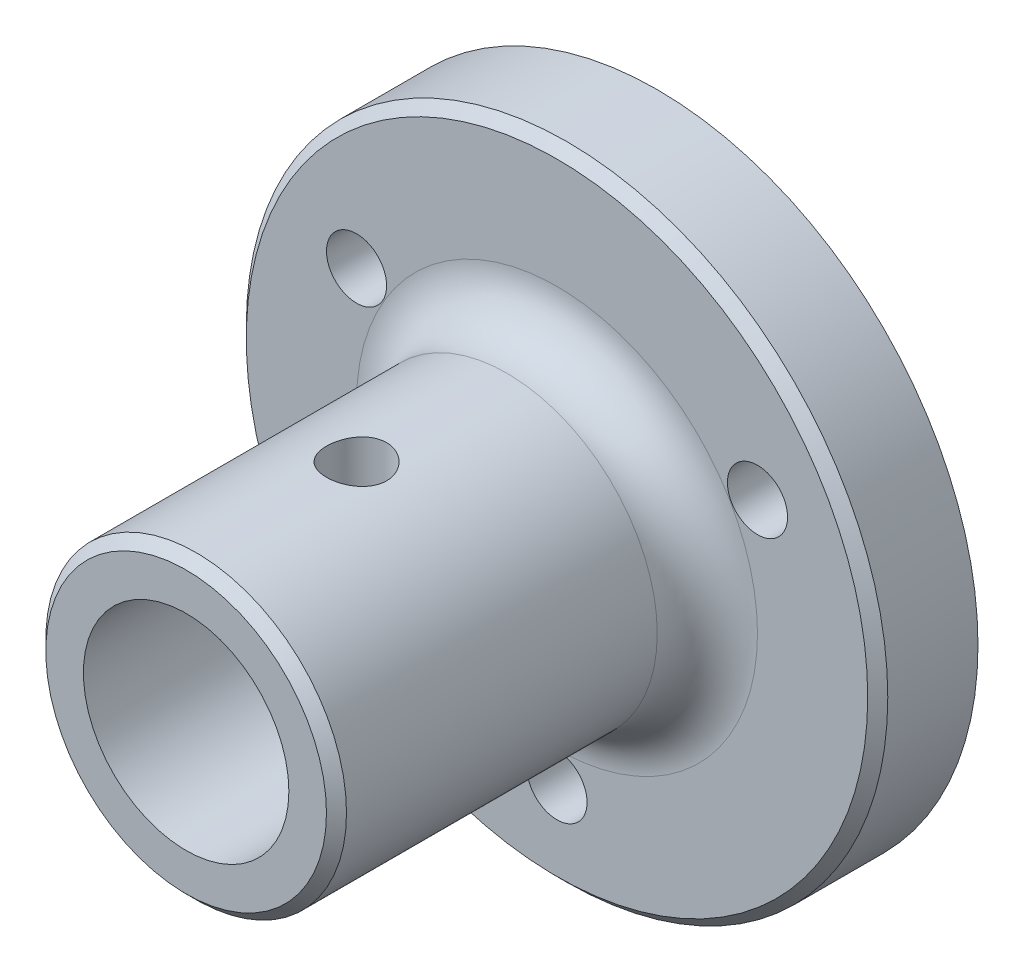
ISO-10303-21;
HEADER;
FILE_DESCRIPTION(('STEP AP214'),'2;1');
FILE_NAME('part.step','',(''),(''),'','','');
FILE_SCHEMA(('AUTOMOTIVE_DESIGN { 1 0 10303 214 1 1 1 1 }'));
ENDSEC;
DATA;
#1=APPLICATION_CONTEXT('core data for automotive mechanical design processes');
#2=APPLICATION_PROTOCOL_DEFINITION('international standard','automotive_design',2000,#1);
#3=PRODUCT_CONTEXT('',#1,'mechanical');
#4=PRODUCT('Part','Part','',(#3));
#5=PRODUCT_RELATED_PRODUCT_CATEGORY('part','',(#4));
#6=PRODUCT_DEFINITION_FORMATION('','',#4);
#7=PRODUCT_DEFINITION_CONTEXT('part definition',#1,'design');
#8=PRODUCT_DEFINITION('design','',#6,#7);
#9=PRODUCT_DEFINITION_SHAPE('','',#8);
#10=(LENGTH_UNIT() NAMED_UNIT(*) SI_UNIT(.MILLI.,.METRE.));
#11=(NAMED_UNIT(*) PLANE_ANGLE_UNIT() SI_UNIT($,.RADIAN.));
#12=(NAMED_UNIT(*) SI_UNIT($,.STERADIAN.) SOLID_ANGLE_UNIT());
#13=UNCERTAINTY_MEASURE_WITH_UNIT(LENGTH_MEASURE(1.E-05),#10,'distance_accuracy_value','');
#14=(GEOMETRIC_REPRESENTATION_CONTEXT(3) GLOBAL_UNCERTAINTY_ASSIGNED_CONTEXT((#13)) GLOBAL_UNIT_ASSIGNED_CONTEXT((#10,
#11,#12)) REPRESENTATION_CONTEXT('',''));
#15=CARTESIAN_POINT('',(0.,0.,0.));
#16=DIRECTION('',(0.,0.,1.));
#17=DIRECTION('',(1.,0.,0.));
#18=AXIS2_PLACEMENT_3D('',#15,#16,#17);
#19=CARTESIAN_POINT('',(0.,0.,10.));
#20=DIRECTION('',(0.,0.,1.));
#21=DIRECTION('',(1.,0.,0.));
#22=AXIS2_PLACEMENT_3D('',#19,#20,#21);
#23=PLANE('',#22);
#24=CARTESIAN_POINT('',(0.,0.,10.));
#25=DIRECTION('',(0.,0.,1.));
#26=DIRECTION('',(1.,0.,0.));
#27=AXIS2_PLACEMENT_3D('',#24,#25,#26);
#28=CIRCLE('',#27,31.);
#29=CARTESIAN_POINT('',(31.,0.,10.));
#30=VERTEX_POINT('',#29);
#31=EDGE_CURVE('E44',#30,#30,#28,.T.);
#32=ORIENTED_EDGE('',*,*,#31,.T.);
#33=EDGE_LOOP('',(#32));
#34=FACE_BOUND('',#33,.T.);
#35=CARTESIAN_POINT('',(0.,0.,10.));
#36=DIRECTION('',(0.,0.,1.));
#37=DIRECTION('',(1.,0.,0.));
#38=AXIS2_PLACEMENT_3D('',#35,#36,#37);
#39=CIRCLE('',#38,20.);
#40=CARTESIAN_POINT('',(20.,0.,10.));
#41=VERTEX_POINT('',#40);
#42=EDGE_CURVE('E57',#41,#41,#39,.F.);
#43=ORIENTED_EDGE('',*,*,#42,.T.);
#44=EDGE_LOOP('',(#43));
#45=FACE_BOUND('',#44,.T.);
#46=CARTESIAN_POINT('',(0.,-23.094010767585,10.));
#47=DIRECTION('',(0.,0.,1.));
#48=DIRECTION('',(1.,0.,0.));
#49=AXIS2_PLACEMENT_3D('',#46,#47,#48);
#50=CIRCLE('',#49,3.);
#51=CARTESIAN_POINT('',(3.,-23.094010767585,10.));
#52=VERTEX_POINT('',#51);
#53=EDGE_CURVE('E162',#52,#52,#50,.T.);
#54=ORIENTED_EDGE('',*,*,#53,.F.);
#55=EDGE_LOOP('',(#54));
#56=FACE_BOUND('',#55,.T.);
#57=CARTESIAN_POINT('',(20.,11.5470053837925,10.));
#58=DIRECTION('',(0.,0.,1.));
#59=DIRECTION('',(1.,0.,0.));
#60=AXIS2_PLACEMENT_3D('',#57,#58,#59);
#61=CIRCLE('',#60,3.);
#62=CARTESIAN_POINT('',(23.,11.5470053837925,10.));
#63=VERTEX_POINT('',#62);
#64=EDGE_CURVE('E168',#63,#63,#61,.T.);
#65=ORIENTED_EDGE('',*,*,#64,.F.);
#66=EDGE_LOOP('',(#65));
#67=FACE_BOUND('',#66,.T.);
#68=CARTESIAN_POINT('',(-20.,11.5470053837925,10.));
#69=DIRECTION('',(0.,0.,1.));
#70=DIRECTION('',(1.,0.,0.));
#71=AXIS2_PLACEMENT_3D('',#68,#69,#70);
#72=CIRCLE('',#71,3.);
#73=CARTESIAN_POINT('',(-17.,11.5470053837925,10.));
#74=VERTEX_POINT('',#73);
#75=EDGE_CURVE('E155',#74,#74,#72,.T.);
#76=ORIENTED_EDGE('',*,*,#75,.F.);
#77=EDGE_LOOP('',(#76));
#78=FACE_BOUND('',#77,.T.);
#79=ADVANCED_FACE('F36',(#34,#45,#56,#67,#78),#23,.T.);
#80=CARTESIAN_POINT('',(0.,0.,0.));
#81=DIRECTION('',(0.,0.,1.));
#82=DIRECTION('',(1.,0.,0.));
#83=AXIS2_PLACEMENT_3D('',#80,#81,#82);
#84=PLANE('',#83);
#85=CARTESIAN_POINT('',(0.,0.,0.));
#86=DIRECTION('',(0.,0.,1.));
#87=DIRECTION('',(1.,0.,0.));
#88=AXIS2_PLACEMENT_3D('',#85,#86,#87);
#89=CIRCLE('',#88,32.);
#90=CARTESIAN_POINT('',(32.,0.,0.));
#91=VERTEX_POINT('',#90);
#92=EDGE_CURVE('E171',#91,#91,#89,.T.);
#93=ORIENTED_EDGE('',*,*,#92,.F.);
#94=EDGE_LOOP('',(#93));
#95=FACE_BOUND('',#94,.T.);
#96=CARTESIAN_POINT('',(20.,11.5470053837925,0.));
#97=DIRECTION('',(0.,0.,1.));
#98=DIRECTION('',(1.,0.,0.));
#99=AXIS2_PLACEMENT_3D('',#96,#97,#98);
#100=CIRCLE('',#99,3.);
#101=CARTESIAN_POINT('',(23.,11.5470053837925,0.));
#102=VERTEX_POINT('',#101);
#103=EDGE_CURVE('E165',#102,#102,#100,.T.);
#104=ORIENTED_EDGE('',*,*,#103,.T.);
#105=EDGE_LOOP('',(#104));
#106=FACE_BOUND('',#105,.T.);
#107=CARTESIAN_POINT('',(0.,-23.094010767585,0.));
#108=DIRECTION('',(0.,0.,1.));
#109=DIRECTION('',(1.,0.,0.));
#110=AXIS2_PLACEMENT_3D('',#107,#108,#109);
#111=CIRCLE('',#110,3.);
#112=CARTESIAN_POINT('',(3.,-23.094010767585,0.));
#113=VERTEX_POINT('',#112);
#114=EDGE_CURVE('E160',#113,#113,#111,.T.);
#115=ORIENTED_EDGE('',*,*,#114,.T.);
#116=EDGE_LOOP('',(#115));
#117=FACE_BOUND('',#116,.T.);
#118=CARTESIAN_POINT('',(-20.,11.5470053837925,0.));
#119=DIRECTION('',(0.,0.,1.));
#120=DIRECTION('',(1.,0.,0.));
#121=AXIS2_PLACEMENT_3D('',#118,#119,#120);
#122=CIRCLE('',#121,3.);
#123=CARTESIAN_POINT('',(-17.,11.5470053837925,0.));
#124=VERTEX_POINT('',#123);
#125=EDGE_CURVE('E153',#124,#124,#122,.T.);
#126=ORIENTED_EDGE('',*,*,#125,.T.);
#127=EDGE_LOOP('',(#126));
#128=FACE_BOUND('',#127,.T.);
#129=ADVANCED_FACE('F124',(#95,#106,#117,#128),#84,.F.);
#130=CARTESIAN_POINT('',(0.,0.,10.));
#131=DIRECTION('',(0.,0.,-1.));
#132=DIRECTION('',(-1.,0.,0.));
#133=AXIS2_PLACEMENT_3D('',#130,#131,#132);
#134=CYLINDRICAL_SURFACE('',#133,32.);
#135=CARTESIAN_POINT('',(0.,0.,9.00000000000001));
#136=DIRECTION('',(0.,0.,1.));
#137=DIRECTION('',(1.,0.,0.));
#138=AXIS2_PLACEMENT_3D('',#135,#136,#137);
#139=CIRCLE('',#138,32.);
#140=CARTESIAN_POINT('',(32.,0.,9.00000000000001));
#141=VERTEX_POINT('',#140);
#142=EDGE_CURVE('E10',#141,#141,#139,.F.);
#143=ORIENTED_EDGE('',*,*,#142,.T.);
#144=EDGE_LOOP('',(#143));
#145=FACE_BOUND('',#144,.T.);
#146=ORIENTED_EDGE('',*,*,#92,.T.);
#147=EDGE_LOOP('',(#146));
#148=FACE_BOUND('',#147,.T.);
#149=ADVANCED_FACE('F120',(#145,#148),#134,.T.);
#150=CARTESIAN_POINT('',(20.,11.5470053837925,10.));
#151=DIRECTION('',(0.,0.,-1.));
#152=DIRECTION('',(-1.,0.,0.));
#153=AXIS2_PLACEMENT_3D('',#150,#151,#152);
#154=CYLINDRICAL_SURFACE('',#153,3.);
#155=ORIENTED_EDGE('',*,*,#64,.T.);
#156=EDGE_LOOP('',(#155));
#157=FACE_BOUND('',#156,.T.);
#158=ORIENTED_EDGE('',*,*,#103,.F.);
#159=EDGE_LOOP('',(#158));
#160=FACE_BOUND('',#159,.T.);
#161=ADVANCED_FACE('F116',(#157,#160),#154,.F.);
#162=CARTESIAN_POINT('',(0.,-23.094010767585,10.));
#163=DIRECTION('',(0.,0.,-1.));
#164=DIRECTION('',(-1.,0.,0.));
#165=AXIS2_PLACEMENT_3D('',#162,#163,#164);
#166=CYLINDRICAL_SURFACE('',#165,3.);
#167=ORIENTED_EDGE('',*,*,#53,.T.);
#168=EDGE_LOOP('',(#167));
#169=FACE_BOUND('',#168,.T.);
#170=ORIENTED_EDGE('',*,*,#114,.F.);
#171=EDGE_LOOP('',(#170));
#172=FACE_BOUND('',#171,.T.);
#173=ADVANCED_FACE('F112',(#169,#172),#166,.F.);
#174=CARTESIAN_POINT('',(-20.,11.5470053837925,10.));
#175=DIRECTION('',(0.,0.,-1.));
#176=DIRECTION('',(-1.,0.,0.));
#177=AXIS2_PLACEMENT_3D('',#174,#175,#176);
#178=CYLINDRICAL_SURFACE('',#177,3.);
#179=ORIENTED_EDGE('',*,*,#75,.T.);
#180=EDGE_LOOP('',(#179));
#181=FACE_BOUND('',#180,.T.);
#182=ORIENTED_EDGE('',*,*,#125,.F.);
#183=EDGE_LOOP('',(#182));
#184=FACE_BOUND('',#183,.T.);
#185=ADVANCED_FACE('F108',(#181,#184),#178,.F.);
#186=CARTESIAN_POINT('',(0.,0.,47.));
#187=DIRECTION('',(0.,0.,1.));
#188=DIRECTION('',(1.,0.,0.));
#189=AXIS2_PLACEMENT_3D('',#186,#187,#188);
#190=PLANE('',#189);
#191=CARTESIAN_POINT('',(0.,0.,47.));
#192=DIRECTION('',(0.,0.,1.));
#193=DIRECTION('',(1.,0.,0.));
#194=AXIS2_PLACEMENT_3D('',#191,#192,#193);
#195=CIRCLE('',#194,14.);
#196=CARTESIAN_POINT('',(14.,0.,47.));
#197=VERTEX_POINT('',#196);
#198=EDGE_CURVE('E52',#197,#197,#195,.T.);
#199=ORIENTED_EDGE('',*,*,#198,.T.);
#200=EDGE_LOOP('',(#199));
#201=FACE_BOUND('',#200,.T.);
#202=CARTESIAN_POINT('',(0.,0.,47.));
#203=DIRECTION('',(0.,0.,1.));
#204=DIRECTION('',(1.,0.,0.));
#205=AXIS2_PLACEMENT_3D('',#202,#203,#204);
#206=CIRCLE('',#205,10.25);
#207=CARTESIAN_POINT('',(10.25,0.,47.));
#208=VERTEX_POINT('',#207);
#209=EDGE_CURVE('E151',#208,#208,#206,.T.);
#210=ORIENTED_EDGE('',*,*,#209,.F.);
#211=EDGE_LOOP('',(#210));
#212=FACE_BOUND('',#211,.T.);
#213=ADVANCED_FACE('F106',(#201,#212),#190,.T.);
#214=CARTESIAN_POINT('',(0.,0.,47.));
#215=DIRECTION('',(0.,0.,-1.));
#216=DIRECTION('',(-1.,0.,0.));
#217=AXIS2_PLACEMENT_3D('',#214,#215,#216);
#218=CYLINDRICAL_SURFACE('',#217,15.);
#219=CARTESIAN_POINT('',(0.,0.,46.));
#220=DIRECTION('',(0.,0.,1.));
#221=DIRECTION('',(1.,0.,0.));
#222=AXIS2_PLACEMENT_3D('',#219,#220,#221);
#223=CIRCLE('',#222,15.);
#224=CARTESIAN_POINT('',(15.,0.,46.));
#225=VERTEX_POINT('',#224);
#226=EDGE_CURVE('E48',#225,#225,#223,.F.);
#227=ORIENTED_EDGE('',*,*,#226,.T.);
#228=EDGE_LOOP('',(#227));
#229=FACE_BOUND('',#228,.T.);
#230=CARTESIAN_POINT('',(0.,0.,15.));
#231=DIRECTION('',(0.,0.,1.));
#232=DIRECTION('',(1.,0.,0.));
#233=AXIS2_PLACEMENT_3D('',#230,#231,#232);
#234=CIRCLE('',#233,15.);
#235=CARTESIAN_POINT('',(15.,0.,15.));
#236=VERTEX_POINT('',#235);
#237=EDGE_CURVE('E60',#236,#236,#234,.T.);
#238=ORIENTED_EDGE('',*,*,#237,.T.);
#239=EDGE_LOOP('',(#238));
#240=FACE_BOUND('',#239,.T.);
#241=CARTESIAN_POINT('',(0.,-15.,33.));
#242=CARTESIAN_POINT('',(0.166730720377901,-14.9999969274261,32.999993866505));
#243=CARTESIAN_POINT('',(0.333538980604569,-14.9971915553469,32.9860534710971));
#244=CARTESIAN_POINT('',(0.66244052306706,-14.9862709686969,32.9307044996543));
#245=CARTESIAN_POINT('',(0.824529952624069,-14.9781515358056,32.8892741015955));
#246=CARTESIAN_POINT('',(1.13919091578994,-14.9575094783486,32.7802761791376));
#247=CARTESIAN_POINT('',(1.2917714037994,-14.9449910723015,32.7127336894659));
#248=CARTESIAN_POINT('',(1.58342396659268,-14.9169119410594,32.5535032574661));
#249=CARTESIAN_POINT('',(1.72249684522744,-14.9013513970712,32.4618167531784));
#250=CARTESIAN_POINT('',(1.98508043194459,-14.8686649598991,32.2555845171257));
#251=CARTESIAN_POINT('',(2.10838185347557,-14.8515223651304,32.1407749338264));
#252=CARTESIAN_POINT('',(2.33411026982409,-14.8177254135776,31.8921227508249));
#253=CARTESIAN_POINT('',(2.43653563431128,-14.8010710950127,31.7582786659946));
#254=CARTESIAN_POINT('',(2.61849526004286,-14.7699732543785,31.4738514209644));
#255=CARTESIAN_POINT('',(2.6978128165976,-14.7555512209484,31.3231270686109));
#256=CARTESIAN_POINT('',(2.82991699974093,-14.7307880417525,31.0101545429878));
#257=CARTESIAN_POINT('',(2.88270624731171,-14.7204464928589,30.847907509961));
#258=CARTESIAN_POINT('',(2.95957589965448,-14.7051841575661,30.5187469082762));
#259=CARTESIAN_POINT('',(2.98402349387633,-14.7001941032156,30.3519223675733));
#260=CARTESIAN_POINT('',(3.00465638317836,-14.6959912518188,30.016470535907));
#261=CARTESIAN_POINT('',(3.0008445681405,-14.6967778640352,29.8478434310396));
#262=CARTESIAN_POINT('',(2.96536371930546,-14.7039765344455,29.516259635937));
#263=CARTESIAN_POINT('',(2.93411562073172,-14.7103035857629,29.3532557831181));
#264=CARTESIAN_POINT('',(2.84531365386915,-14.7277363848,29.034851770011));
#265=CARTESIAN_POINT('',(2.78775852930205,-14.7388423607334,28.879451973243));
#266=CARTESIAN_POINT('',(2.64757435102416,-14.7646685550122,28.5794542148892));
#267=CARTESIAN_POINT('',(2.56477845369635,-14.7794126944111,28.4349363612925));
#268=CARTESIAN_POINT('',(2.37658072371804,-14.8108385631919,28.1616874500816));
#269=CARTESIAN_POINT('',(2.27117629307049,-14.827520515151,28.0329582094465));
#270=CARTESIAN_POINT('',(2.03849980368175,-14.8613106372439,27.7925117926292));
#271=CARTESIAN_POINT('',(1.91086848363734,-14.8784210763271,27.6811422964226));
#272=CARTESIAN_POINT('',(1.63855507218603,-14.9108654614323,27.4813384610963));
#273=CARTESIAN_POINT('',(1.49387276213817,-14.9261993846692,27.3929044161193));
#274=CARTESIAN_POINT('',(1.19117816063676,-14.9534007048266,27.2414174723221));
#275=CARTESIAN_POINT('',(1.0331454587559,-14.9652626654482,27.1784043190664));
#276=CARTESIAN_POINT('',(0.708446929345996,-14.9841422696357,27.0799185778843));
#277=CARTESIAN_POINT('',(0.541782150217351,-14.9911605000159,27.0444426537791));
#278=CARTESIAN_POINT('',(0.207538216881454,-14.999480156006,27.0025306386172));
#279=CARTESIAN_POINT('',(0.0400209849767314,-15.0008752395741,26.9956187413792));
#280=CARTESIAN_POINT('',(-0.293774802578139,-14.9980515579031,27.0097495768265));
#281=CARTESIAN_POINT('',(-0.460053427331377,-14.9938331082434,27.0307907380578));
#282=CARTESIAN_POINT('',(-0.785116979839619,-14.9803149602405,27.0998351206319));
#283=CARTESIAN_POINT('',(-0.943955845019705,-14.9710612921262,27.1475942054937));
#284=CARTESIAN_POINT('',(-1.251370882499,-14.948506561831,27.2684519479674));
#285=CARTESIAN_POINT('',(-1.39994628491262,-14.9352051964268,27.3415525040305));
#286=CARTESIAN_POINT('',(-1.68462352105865,-14.9057973459988,27.5120474719539));
#287=CARTESIAN_POINT('',(-1.82055038025656,-14.8896585131116,27.6097283431168));
#288=CARTESIAN_POINT('',(-2.07425405735762,-14.8564420448965,27.8262275736218));
#289=CARTESIAN_POINT('',(-2.19202892679229,-14.8393643090516,27.9450481991996));
#290=CARTESIAN_POINT('',(-2.40792177232253,-14.8058791067089,28.2026200556734));
#291=CARTESIAN_POINT('',(-2.50571310734596,-14.7894858069991,28.341647232664));
#292=CARTESIAN_POINT('',(-2.67655626015362,-14.7595257538858,28.63443408407));
#293=CARTESIAN_POINT('',(-2.74960906776871,-14.7459588874003,28.7881931687207));
#294=CARTESIAN_POINT('',(-2.86845552474588,-14.7233022175315,29.1053047384486));
#295=CARTESIAN_POINT('',(-2.91439049937315,-14.7141892461656,29.268602523631));
#296=CARTESIAN_POINT('',(-2.97812595488159,-14.7014231037608,29.6008003604727));
#297=CARTESIAN_POINT('',(-2.99593010467534,-14.6977692207333,29.769699678628));
#298=CARTESIAN_POINT('',(-3.0027627326024,-14.6963744889414,30.105026593633));
#299=CARTESIAN_POINT('',(-2.99230736421269,-14.698527575679,30.271443446781));
#300=CARTESIAN_POINT('',(-2.94405691230018,-14.7082672045384,30.6000949497151));
#301=CARTESIAN_POINT('',(-2.90626204838789,-14.7158537030151,30.7623296330844));
#302=CARTESIAN_POINT('',(-2.80463570549686,-14.7355579265748,31.0776831337216));
#303=CARTESIAN_POINT('',(-2.74086752015203,-14.7476646305649,31.2308230815072));
#304=CARTESIAN_POINT('',(-2.58916393380481,-14.7750514492251,31.5243111622033));
#305=CARTESIAN_POINT('',(-2.50122650632465,-14.7903318299668,31.6646582211754));
#306=CARTESIAN_POINT('',(-2.30191774435924,-14.8226688156968,31.9311467164509));
#307=CARTESIAN_POINT('',(-2.19017366170554,-14.839751187291,32.0570062958028));
#308=CARTESIAN_POINT('',(-1.94719310703942,-14.8735824561586,32.2883586165875));
#309=CARTESIAN_POINT('',(-1.81595216146,-14.8903312758955,32.3938466709518));
#310=CARTESIAN_POINT('',(-1.53605288726474,-14.9218149716391,32.5825039318393));
#311=CARTESIAN_POINT('',(-1.3872266532895,-14.9365269365774,32.6654280098401));
#312=CARTESIAN_POINT('',(-1.0774990828222,-14.96205375255,32.8049583677898));
#313=CARTESIAN_POINT('',(-0.916608782589378,-14.9728721141585,32.8615883685975));
#314=CARTESIAN_POINT('',(-0.629464466771338,-14.9872911778611,32.9359558441341));
#315=CARTESIAN_POINT('',(-0.504844992041353,-14.9920290947535,32.9599295811233));
#316=CARTESIAN_POINT('',(-0.253498575630199,-14.9983846241968,32.9919537370751));
#317=CARTESIAN_POINT('',(-0.126771701245855,-15.0000023361946,33.0000046635293));
#318=CARTESIAN_POINT('',(0.,-15.,33.));
#319=B_SPLINE_CURVE_WITH_KNOTS('',3,(#241,#242,#243,#244,#245,#246,#247,#248,#249,#250,#251,
#252,#253,#254,#255,#256,#257,#258,#259,#260,#261,#262,#263,#264,#265,#266,#267,#268,#269,#270,
#271,#272,#273,#274,#275,#276,#277,#278,#279,#280,#281,#282,#283,#284,#285,#286,#287,#288,#289,
#290,#291,#292,#293,#294,#295,#296,#297,#298,#299,#300,#301,#302,#303,#304,#305,#306,#307,#308,
#309,#310,#311,#312,#313,#314,#315,#316,#317,#318),.UNSPECIFIED.,.T.,.F.,(4,2,2,2,2,2,2,2,2,2,2,
2,2,2,2,2,2,2,2,2,2,2,2,2,2,2,2,2,2,2,2,2,2,2,2,2,2,2,4),(0.,0.499728391983775,
0.999853952073969,1.49950120575102,1.99911870669259,2.50479801033655,3.0105167902421,
3.52083585017768,4.03110448095592,4.53468555310762,5.03821512843675,5.53415181018835,
6.03011217761189,6.52942470610778,7.02879464249012,7.53714757474052,8.04550702619461,
8.55465824562072,9.06374777094108,9.56432207028796,10.064868229736,10.5609136185217,
11.0569961764807,11.5591519810008,12.0613616503779,12.5712188573768,13.081055661704,
13.5882114309817,14.0953010499124,14.593191677031,15.0910783047783,15.5877588375933,
16.084481027456,16.5896422871743,17.0949196359879,17.6054849002691,18.1155886655256,
18.4955632586968,18.8755257411299),.UNSPECIFIED.);
#320=CARTESIAN_POINT('',(0.,-15.,33.));
#321=VERTEX_POINT('',#320);
#322=EDGE_CURVE('E97',#321,#321,#319,.T.);
#323=ORIENTED_EDGE('',*,*,#322,.T.);
#324=EDGE_LOOP('',(#323));
#325=FACE_BOUND('',#324,.T.);
#326=CARTESIAN_POINT('',(0.,15.,33.));
#327=CARTESIAN_POINT('',(-0.166730720377898,14.9999969274261,32.999993866505));
#328=CARTESIAN_POINT('',(-0.333538980604565,14.9971915553469,32.9860534710971));
#329=CARTESIAN_POINT('',(-0.662440523067056,14.9862709686969,32.9307044996543));
#330=CARTESIAN_POINT('',(-0.824529952624065,14.9781515358056,32.8892741015955));
#331=CARTESIAN_POINT('',(-1.13919091578994,14.9575094783486,32.7802761791376));
#332=CARTESIAN_POINT('',(-1.2917714037994,14.9449910723015,32.7127336894659));
#333=CARTESIAN_POINT('',(-1.58342396659267,14.9169119410594,32.5535032574661));
#334=CARTESIAN_POINT('',(-1.72249684522743,14.9013513970712,32.4618167531784));
#335=CARTESIAN_POINT('',(-1.98508043194459,14.8686649598991,32.2555845171257));
#336=CARTESIAN_POINT('',(-2.10838185347557,14.8515223651304,32.1407749338264));
#337=CARTESIAN_POINT('',(-2.33411026982408,14.8177254135776,31.8921227508249));
#338=CARTESIAN_POINT('',(-2.43653563431127,14.8010710950127,31.7582786659946));
#339=CARTESIAN_POINT('',(-2.61849526004286,14.7699732543785,31.4738514209644));
#340=CARTESIAN_POINT('',(-2.6978128165976,14.7555512209484,31.3231270686109));
#341=CARTESIAN_POINT('',(-2.82991699974092,14.7307880417525,31.0101545429878));
#342=CARTESIAN_POINT('',(-2.88270624731171,14.7204464928588,30.847907509961));
#343=CARTESIAN_POINT('',(-2.95957589965448,14.7051841575661,30.5187469082762));
#344=CARTESIAN_POINT('',(-2.98402349387633,14.7001941032156,30.3519223675733));
#345=CARTESIAN_POINT('',(-3.00465638317836,14.6959912518188,30.016470535907));
#346=CARTESIAN_POINT('',(-3.0008445681405,14.6967778640352,29.8478434310396));
#347=CARTESIAN_POINT('',(-2.96536371930546,14.7039765344455,29.516259635937));
#348=CARTESIAN_POINT('',(-2.93411562073172,14.7103035857629,29.3532557831181));
#349=CARTESIAN_POINT('',(-2.84531365386915,14.7277363848,29.034851770011));
#350=CARTESIAN_POINT('',(-2.78775852930204,14.7388423607334,28.879451973243));
#351=CARTESIAN_POINT('',(-2.64757435102416,14.7646685550122,28.5794542148892));
#352=CARTESIAN_POINT('',(-2.56477845369634,14.7794126944111,28.4349363612925));
#353=CARTESIAN_POINT('',(-2.37658072371804,14.8108385631919,28.1616874500816));
#354=CARTESIAN_POINT('',(-2.27117629307049,14.827520515151,28.0329582094465));
#355=CARTESIAN_POINT('',(-2.03849980368175,14.8613106372439,27.7925117926292));
#356=CARTESIAN_POINT('',(-1.91086848363733,14.8784210763271,27.6811422964226));
#357=CARTESIAN_POINT('',(-1.63855507218603,14.9108654614323,27.4813384610963));
#358=CARTESIAN_POINT('',(-1.49387276213817,14.9261993846692,27.3929044161193));
#359=CARTESIAN_POINT('',(-1.19117816063676,14.9534007048266,27.2414174723221));
#360=CARTESIAN_POINT('',(-1.0331454587559,14.9652626654482,27.1784043190664));
#361=CARTESIAN_POINT('',(-0.708446929345993,14.9841422696357,27.0799185778843));
#362=CARTESIAN_POINT('',(-0.541782150217348,14.9911605000159,27.0444426537791));
#363=CARTESIAN_POINT('',(-0.207538216881451,14.999480156006,27.0025306386172));
#364=CARTESIAN_POINT('',(-0.0400209849767283,15.0008752395741,26.9956187413792));
#365=CARTESIAN_POINT('',(0.293774802578143,14.9980515579031,27.0097495768265));
#366=CARTESIAN_POINT('',(0.46005342733138,14.9938331082434,27.0307907380578));
#367=CARTESIAN_POINT('',(0.785116979839623,14.9803149602405,27.0998351206319));
#368=CARTESIAN_POINT('',(0.943955845019709,14.9710612921262,27.1475942054937));
#369=CARTESIAN_POINT('',(1.251370882499,14.948506561831,27.2684519479674));
#370=CARTESIAN_POINT('',(1.39994628491262,14.9352051964268,27.3415525040305));
#371=CARTESIAN_POINT('',(1.68462352105865,14.9057973459988,27.5120474719539));
#372=CARTESIAN_POINT('',(1.82055038025656,14.8896585131116,27.6097283431168));
#373=CARTESIAN_POINT('',(2.07425405735762,14.8564420448965,27.8262275736218));
#374=CARTESIAN_POINT('',(2.19202892679229,14.8393643090516,27.9450481991996));
#375=CARTESIAN_POINT('',(2.40792177232253,14.8058791067089,28.2026200556734));
#376=CARTESIAN_POINT('',(2.50571310734597,14.7894858069991,28.341647232664));
#377=CARTESIAN_POINT('',(2.67655626015362,14.7595257538858,28.63443408407));
#378=CARTESIAN_POINT('',(2.74960906776871,14.7459588874003,28.7881931687207));
#379=CARTESIAN_POINT('',(2.86845552474588,14.7233022175315,29.1053047384486));
#380=CARTESIAN_POINT('',(2.91439049937315,14.7141892461656,29.268602523631));
#381=CARTESIAN_POINT('',(2.97812595488159,14.7014231037608,29.6008003604727));
#382=CARTESIAN_POINT('',(2.99593010467534,14.6977692207333,29.769699678628));
#383=CARTESIAN_POINT('',(3.00276273260241,14.6963744889414,30.105026593633));
#384=CARTESIAN_POINT('',(2.99230736421269,14.698527575679,30.271443446781));
#385=CARTESIAN_POINT('',(2.94405691230018,14.7082672045384,30.6000949497151));
#386=CARTESIAN_POINT('',(2.9062620483879,14.7158537030151,30.7623296330844));
#387=CARTESIAN_POINT('',(2.80463570549687,14.7355579265748,31.0776831337216));
#388=CARTESIAN_POINT('',(2.74086752015204,14.7476646305649,31.2308230815072));
#389=CARTESIAN_POINT('',(2.58916393380482,14.7750514492251,31.5243111622033));
#390=CARTESIAN_POINT('',(2.50122650632465,14.7903318299668,31.6646582211754));
#391=CARTESIAN_POINT('',(2.30191774435925,14.8226688156968,31.9311467164509));
#392=CARTESIAN_POINT('',(2.19017366170555,14.839751187291,32.0570062958028));
#393=CARTESIAN_POINT('',(1.94719310703943,14.8735824561586,32.2883586165875));
#394=CARTESIAN_POINT('',(1.81595216146001,14.8903312758955,32.3938466709518));
#395=CARTESIAN_POINT('',(1.53605288726474,14.9218149716391,32.5825039318393));
#396=CARTESIAN_POINT('',(1.3872266532895,14.9365269365774,32.6654280098401));
#397=CARTESIAN_POINT('',(1.0774990828222,14.96205375255,32.8049583677898));
#398=CARTESIAN_POINT('',(0.91660878258938,14.9728721141585,32.8615883685975));
#399=CARTESIAN_POINT('',(0.629464466771343,14.9872911778611,32.9359558441341));
#400=CARTESIAN_POINT('',(0.504844992041359,14.9920290947536,32.9599295811233));
#401=CARTESIAN_POINT('',(0.253498575630206,14.9983846241968,32.9919537370751));
#402=CARTESIAN_POINT('',(0.12677170124586,15.0000023361946,33.0000046635293));
#403=CARTESIAN_POINT('',(0.,15.,33.));
#404=B_SPLINE_CURVE_WITH_KNOTS('',3,(#326,#327,#328,#329,#330,#331,#332,#333,#334,#335,#336,
#337,#338,#339,#340,#341,#342,#343,#344,#345,#346,#347,#348,#349,#350,#351,#352,#353,#354,#355,
#356,#357,#358,#359,#360,#361,#362,#363,#364,#365,#366,#367,#368,#369,#370,#371,#372,#373,#374,
#375,#376,#377,#378,#379,#380,#381,#382,#383,#384,#385,#386,#387,#388,#389,#390,#391,#392,#393,
#394,#395,#396,#397,#398,#399,#400,#401,#402,#403),.UNSPECIFIED.,.T.,.F.,(4,2,2,2,2,2,2,2,2,2,2,
2,2,2,2,2,2,2,2,2,2,2,2,2,2,2,2,2,2,2,2,2,2,2,2,2,2,2,4),(0.,0.499728391983775,
0.999853952073969,1.49950120575102,1.99911870669259,2.50479801033656,3.0105167902421,
3.52083585017768,4.03110448095592,4.53468555310762,5.03821512843675,5.53415181018835,
6.03011217761189,6.52942470610778,7.02879464249012,7.53714757474052,8.04550702619461,
8.55465824562072,9.06374777094108,9.56432207028796,10.064868229736,10.5609136185217,
11.0569961764807,11.5591519810008,12.0613616503779,12.5712188573768,13.081055661704,
13.5882114309817,14.0953010499124,14.593191677031,15.0910783047783,15.5877588375933,
16.084481027456,16.5896422871743,17.0949196359879,17.6054849002691,18.1155886655256,
18.4955632586968,18.8755257411299),.UNSPECIFIED.);
#405=CARTESIAN_POINT('',(0.,15.,33.));
#406=VERTEX_POINT('',#405);
#407=EDGE_CURVE('E72',#406,#406,#404,.T.);
#408=ORIENTED_EDGE('',*,*,#407,.T.);
#409=EDGE_LOOP('',(#408));
#410=FACE_BOUND('',#409,.T.);
#411=ADVANCED_FACE('F102',(#229,#240,#325,#410),#218,.T.);
#412=CARTESIAN_POINT('',(0.,0.,47.));
#413=DIRECTION('',(0.,0.,-1.));
#414=DIRECTION('',(-1.,0.,0.));
#415=AXIS2_PLACEMENT_3D('',#412,#413,#414);
#416=CYLINDRICAL_SURFACE('',#415,10.25);
#417=CARTESIAN_POINT('',(0.,-10.25,33.));
#418=CARTESIAN_POINT('',(0.164761030351973,-10.2499982885748,32.9999975190535));
#419=CARTESIAN_POINT('',(0.329547295458406,-10.2459891477057,32.9863817687285));
#420=CARTESIAN_POINT('',(0.654332795535697,-10.230386996352,32.9324001987746));
#421=CARTESIAN_POINT('',(0.814330385454751,-10.2187914102722,32.8920252943628));
#422=CARTESIAN_POINT('',(1.12480632609575,-10.1892890680163,32.7859804168264));
#423=CARTESIAN_POINT('',(1.27529796475204,-10.1713913623467,32.7203467055076));
#424=CARTESIAN_POINT('',(1.56313982492937,-10.1311520971023,32.5657928042986));
#425=CARTESIAN_POINT('',(1.70048848640622,-10.1088100109555,32.4768698546939));
#426=CARTESIAN_POINT('',(1.96191733576444,-10.0613857012864,32.2756873283128));
#427=CARTESIAN_POINT('',(2.08558550559553,-10.0362493869492,32.1629051234802));
#428=CARTESIAN_POINT('',(2.31255048619464,-9.98639778591535,31.9183201581798));
#429=CARTESIAN_POINT('',(2.41584406583257,-9.96168256656547,31.7865143865661));
#430=CARTESIAN_POINT('',(2.60125899002276,-9.91490371417962,31.5041829707671));
#431=CARTESIAN_POINT('',(2.68288409015477,-9.89290754305841,31.3533192064768));
#432=CARTESIAN_POINT('',(2.81943980977289,-9.8548627546537,31.039259257862));
#433=CARTESIAN_POINT('',(2.87437649194788,-9.83881278679458,30.8760658841424));
#434=CARTESIAN_POINT('',(2.95452269393277,-9.81504013380612,30.5465920394521));
#435=CARTESIAN_POINT('',(2.98048902579986,-9.80710592181539,30.380511329967));
#436=CARTESIAN_POINT('',(3.00431990686238,-9.79983320781897,30.0461759626777));
#437=CARTESIAN_POINT('',(3.00219089805734,-9.80049273534856,29.8779218120622));
#438=CARTESIAN_POINT('',(2.97048742281734,-9.81014508286663,29.5501118347946));
#439=CARTESIAN_POINT('',(2.94185346758437,-9.81885231917808,29.3904552598311));
#440=CARTESIAN_POINT('',(2.85946944140989,-9.8431580704573,29.0783189217587));
#441=CARTESIAN_POINT('',(2.80571699957748,-9.85875723593486,28.9258398376167));
#442=CARTESIAN_POINT('',(2.67391255524926,-9.89532234434978,28.630052025485));
#443=CARTESIAN_POINT('',(2.59554994462267,-9.91635624177806,28.4868904643772));
#444=CARTESIAN_POINT('',(2.41696561895684,-9.9613872850994,28.2154303925274));
#445=CARTESIAN_POINT('',(2.31673882796467,-9.98538511853289,28.0871353437789));
#446=CARTESIAN_POINT('',(2.09256856581137,-10.0348053395161,27.8437063685429));
#447=CARTESIAN_POINT('',(1.96784238280467,-10.0602464857032,27.7292958492287));
#448=CARTESIAN_POINT('',(1.70065773106956,-10.1088414191559,27.5228512766226));
#449=CARTESIAN_POINT('',(1.55819825155492,-10.1319950759012,27.4308184997311));
#450=CARTESIAN_POINT('',(1.25832091873287,-10.1736007103458,27.271330925749));
#451=CARTESIAN_POINT('',(1.10081695121619,-10.1920230825114,27.2040298075662));
#452=CARTESIAN_POINT('',(0.776062838465764,-10.2218771397365,27.097082382971));
#453=CARTESIAN_POINT('',(0.608815288482844,-10.2333106770663,27.0574287486769));
#454=CARTESIAN_POINT('',(0.275476791208137,-10.2476087603624,27.0080905027579));
#455=CARTESIAN_POINT('',(0.109542867087531,-10.2507537181414,26.9974247917969));
#456=CARTESIAN_POINT('',(-0.221751346556174,-10.2489391883311,27.003624528379));
#457=CARTESIAN_POINT('',(-0.3871117059723,-10.2439807256534,27.020486494252));
#458=CARTESIAN_POINT('',(-0.708907880964285,-10.2266995731309,27.0804667180821));
#459=CARTESIAN_POINT('',(-0.865458795863897,-10.2145361074543,27.1230176519933));
#460=CARTESIAN_POINT('',(-1.16917031023221,-10.1842453367686,27.2324908383317));
#461=CARTESIAN_POINT('',(-1.31632979951197,-10.1661173282263,27.2994159658577));
#462=CARTESIAN_POINT('',(-1.6007376333411,-10.1252781031291,27.4574236625686));
#463=CARTESIAN_POINT('',(-1.7376904484053,-10.1024733915115,27.5490133691434));
#464=CARTESIAN_POINT('',(-1.99461950577328,-10.0549039781344,27.7531294159292));
#465=CARTESIAN_POINT('',(-2.11459168317153,-10.0301388092763,27.8656607543738));
#466=CARTESIAN_POINT('',(-2.33843282820621,-9.98037315954647,28.113070278167));
#467=CARTESIAN_POINT('',(-2.44160478686513,-9.95539395570076,28.2485846821351));
#468=CARTESIAN_POINT('',(-2.62378498624162,-9.90894158446663,28.5355442932646));
#469=CARTESIAN_POINT('',(-2.70279397633861,-9.88746830835657,28.6869890061748));
#470=CARTESIAN_POINT('',(-2.83384433731139,-9.85070881104072,29.0009476228179));
#471=CARTESIAN_POINT('',(-2.88602104776955,-9.83539162636926,29.1634012022179));
#472=CARTESIAN_POINT('',(-2.9621376686088,-9.81273906354755,29.4953159637075));
#473=CARTESIAN_POINT('',(-2.98608666871315,-9.80540111602868,29.6647748717781));
#474=CARTESIAN_POINT('',(-3.00447077094816,-9.79978244305746,29.9986741615082));
#475=CARTESIAN_POINT('',(-3.00003820655236,-9.80115420912001,30.1630471912933));
#476=CARTESIAN_POINT('',(-2.96447047001477,-9.81196987267041,30.4885940039044));
#477=CARTESIAN_POINT('',(-2.93333627294418,-9.82141347539663,30.6497679033341));
#478=CARTESIAN_POINT('',(-2.8459639231665,-9.84708138643155,30.9625882462732));
#479=CARTESIAN_POINT('',(-2.79001188127977,-9.8632282841048,31.1143214181089));
#480=CARTESIAN_POINT('',(-2.65481394126726,-9.90047257819711,31.4063673303194));
#481=CARTESIAN_POINT('',(-2.57556375480527,-9.92157088584529,31.5466779621459));
#482=CARTESIAN_POINT('',(-2.39278153609463,-9.96725898827188,31.8171853388421));
#483=CARTESIAN_POINT('',(-2.28849929196275,-9.99194486293671,31.9468589490337));
#484=CARTESIAN_POINT('',(-2.05998084382639,-10.0415451100341,32.1872335163894));
#485=CARTESIAN_POINT('',(-1.93573954751622,-10.0664595392459,32.297929616737));
#486=CARTESIAN_POINT('',(-1.66673369726187,-10.11452652781,32.5002165676039));
#487=CARTESIAN_POINT('',(-1.52150065002675,-10.1376122367225,32.5912018710164));
#488=CARTESIAN_POINT('',(-1.21712309212918,-10.1786359424675,32.7473316381438));
#489=CARTESIAN_POINT('',(-1.05798571107092,-10.1965765575289,32.812489251496));
#490=CARTESIAN_POINT('',(-0.750037329507711,-10.2235467251828,32.9086533260251));
#491=CARTESIAN_POINT('',(-0.602277274065562,-10.2333870177589,32.9428186803763));
#492=CARTESIAN_POINT('',(-0.303018218768165,-10.2466139606282,32.9884914677201));
#493=CARTESIAN_POINT('',(-0.151519780227636,-10.2500015738841,33.0000022815618));
#494=CARTESIAN_POINT('',(0.,-10.25,33.));
#495=B_SPLINE_CURVE_WITH_KNOTS('',3,(#417,#418,#419,#420,#421,#422,#423,#424,#425,#426,#427,
#428,#429,#430,#431,#432,#433,#434,#435,#436,#437,#438,#439,#440,#441,#442,#443,#444,#445,#446,
#447,#448,#449,#450,#451,#452,#453,#454,#455,#456,#457,#458,#459,#460,#461,#462,#463,#464,#465,
#466,#467,#468,#469,#470,#471,#472,#473,#474,#475,#476,#477,#478,#479,#480,#481,#482,#483,#484,
#485,#486,#487,#488,#489,#490,#491,#492,#493,#494),.UNSPECIFIED.,.T.,.F.,(4,2,2,2,2,2,2,2,2,2,2,
2,2,2,2,2,2,2,2,2,2,2,2,2,2,2,2,2,2,2,2,2,2,2,2,2,2,2,4),(0.,0.493726734338207,
0.987621175753448,1.48080920633221,1.97405570488177,2.47949748421678,2.98501935534299,
3.50127745347596,4.01741822065636,4.51973447382358,5.02193555256149,5.50697252332598,
5.99205528514922,6.48352459901597,6.97510813326561,7.48618028214054,7.99728157514173,
8.51150712228777,9.02559632365172,9.52205577525038,10.0184524400735,10.5042682205151,
10.9901413247397,11.4868885964294,11.9837545814407,12.4977349514636,13.011699379514,
13.5230453442766,14.0342266033578,14.5251440018394,15.0160434741124,15.5014250662542,
15.9868960553894,16.4892919380903,16.991816205067,17.5080888117488,18.0240982301967,
18.4782137015786,18.9322613979278),.UNSPECIFIED.);
#496=CARTESIAN_POINT('',(0.,-10.25,33.));
#497=VERTEX_POINT('',#496);
#498=EDGE_CURVE('E64',#497,#497,#495,.T.);
#499=ORIENTED_EDGE('',*,*,#498,.F.);
#500=EDGE_LOOP('',(#499));
#501=FACE_BOUND('',#500,.T.);
#502=CARTESIAN_POINT('',(0.,10.25,33.));
#503=CARTESIAN_POINT('',(-0.16476103035197,10.2499982885748,32.9999975190535));
#504=CARTESIAN_POINT('',(-0.329547295458402,10.2459891477057,32.9863817687285));
#505=CARTESIAN_POINT('',(-0.654332795535693,10.230386996352,32.9324001987746));
#506=CARTESIAN_POINT('',(-0.814330385454748,10.2187914102722,32.8920252943628));
#507=CARTESIAN_POINT('',(-1.12480632609575,10.1892890680163,32.7859804168264));
#508=CARTESIAN_POINT('',(-1.27529796475204,10.1713913623467,32.7203467055076));
#509=CARTESIAN_POINT('',(-1.56313982492936,10.1311520971023,32.5657928042986));
#510=CARTESIAN_POINT('',(-1.70048848640622,10.1088100109555,32.4768698546939));
#511=CARTESIAN_POINT('',(-1.96191733576444,10.0613857012864,32.2756873283128));
#512=CARTESIAN_POINT('',(-2.08558550559553,10.0362493869492,32.1629051234802));
#513=CARTESIAN_POINT('',(-2.31255048619464,9.98639778591535,31.9183201581798));
#514=CARTESIAN_POINT('',(-2.41584406583256,9.96168256656548,31.7865143865661));
#515=CARTESIAN_POINT('',(-2.60125899002276,9.91490371417962,31.5041829707671));
#516=CARTESIAN_POINT('',(-2.68288409015477,9.89290754305841,31.3533192064768));
#517=CARTESIAN_POINT('',(-2.81943980977289,9.85486275465371,31.039259257862));
#518=CARTESIAN_POINT('',(-2.87437649194788,9.83881278679458,30.8760658841424));
#519=CARTESIAN_POINT('',(-2.95452269393277,9.81504013380612,30.5465920394521));
#520=CARTESIAN_POINT('',(-2.98048902579986,9.80710592181539,30.380511329967));
#521=CARTESIAN_POINT('',(-3.00431990686238,9.79983320781898,30.0461759626777));
#522=CARTESIAN_POINT('',(-3.00219089805733,9.80049273534856,29.8779218120622));
#523=CARTESIAN_POINT('',(-2.97048742281734,9.81014508286663,29.5501118347946));
#524=CARTESIAN_POINT('',(-2.94185346758437,9.81885231917808,29.3904552598311));
#525=CARTESIAN_POINT('',(-2.85946944140989,9.8431580704573,29.0783189217587));
#526=CARTESIAN_POINT('',(-2.80571699957747,9.85875723593486,28.9258398376167));
#527=CARTESIAN_POINT('',(-2.67391255524925,9.89532234434978,28.630052025485));
#528=CARTESIAN_POINT('',(-2.59554994462267,9.91635624177806,28.4868904643772));
#529=CARTESIAN_POINT('',(-2.41696561895684,9.9613872850994,28.2154303925274));
#530=CARTESIAN_POINT('',(-2.31673882796467,9.98538511853289,28.0871353437789));
#531=CARTESIAN_POINT('',(-2.09256856581136,10.0348053395161,27.8437063685429));
#532=CARTESIAN_POINT('',(-1.96784238280467,10.0602464857032,27.7292958492287));
#533=CARTESIAN_POINT('',(-1.70065773106955,10.1088414191559,27.5228512766226));
#534=CARTESIAN_POINT('',(-1.55819825155491,10.1319950759012,27.4308184997311));
#535=CARTESIAN_POINT('',(-1.25832091873287,10.1736007103458,27.271330925749));
#536=CARTESIAN_POINT('',(-1.10081695121619,10.1920230825114,27.2040298075662));
#537=CARTESIAN_POINT('',(-0.77606283846576,10.2218771397365,27.097082382971));
#538=CARTESIAN_POINT('',(-0.608815288482841,10.2333106770663,27.0574287486769));
#539=CARTESIAN_POINT('',(-0.275476791208134,10.2476087603624,27.0080905027579));
#540=CARTESIAN_POINT('',(-0.109542867087528,10.2507537181414,26.9974247917969));
#541=CARTESIAN_POINT('',(0.221751346556177,10.2489391883311,27.003624528379));
#542=CARTESIAN_POINT('',(0.387111705972304,10.2439807256534,27.020486494252));
#543=CARTESIAN_POINT('',(0.708907880964288,10.2266995731309,27.0804667180821));
#544=CARTESIAN_POINT('',(0.8654587958639,10.2145361074543,27.1230176519933));
#545=CARTESIAN_POINT('',(1.16917031023221,10.1842453367686,27.2324908383317));
#546=CARTESIAN_POINT('',(1.31632979951198,10.1661173282263,27.2994159658577));
#547=CARTESIAN_POINT('',(1.60073763334111,10.1252781031291,27.4574236625686));
#548=CARTESIAN_POINT('',(1.73769044840531,10.1024733915115,27.5490133691434));
#549=CARTESIAN_POINT('',(1.99461950577329,10.0549039781344,27.7531294159292));
#550=CARTESIAN_POINT('',(2.11459168317154,10.0301388092763,27.8656607543738));
#551=CARTESIAN_POINT('',(2.33843282820621,9.98037315954647,28.113070278167));
#552=CARTESIAN_POINT('',(2.44160478686513,9.95539395570076,28.2485846821351));
#553=CARTESIAN_POINT('',(2.62378498624162,9.90894158446663,28.5355442932646));
#554=CARTESIAN_POINT('',(2.70279397633861,9.88746830835656,28.6869890061748));
#555=CARTESIAN_POINT('',(2.83384433731139,9.85070881104072,29.0009476228179));
#556=CARTESIAN_POINT('',(2.88602104776956,9.83539162636926,29.1634012022179));
#557=CARTESIAN_POINT('',(2.9621376686088,9.81273906354755,29.4953159637075));
#558=CARTESIAN_POINT('',(2.98608666871315,9.80540111602868,29.6647748717781));
#559=CARTESIAN_POINT('',(3.00447077094816,9.79978244305745,29.9986741615082));
#560=CARTESIAN_POINT('',(3.00003820655237,9.80115420912001,30.1630471912933));
#561=CARTESIAN_POINT('',(2.96447047001478,9.81196987267041,30.4885940039044));
#562=CARTESIAN_POINT('',(2.93333627294418,9.82141347539663,30.6497679033341));
#563=CARTESIAN_POINT('',(2.84596392316651,9.84708138643155,30.9625882462732));
#564=CARTESIAN_POINT('',(2.79001188127978,9.8632282841048,31.1143214181089));
#565=CARTESIAN_POINT('',(2.65481394126727,9.90047257819711,31.4063673303194));
#566=CARTESIAN_POINT('',(2.57556375480527,9.92157088584529,31.5466779621459));
#567=CARTESIAN_POINT('',(2.39278153609464,9.96725898827188,31.8171853388421));
#568=CARTESIAN_POINT('',(2.28849929196276,9.99194486293671,31.9468589490337));
#569=CARTESIAN_POINT('',(2.05998084382639,10.0415451100341,32.1872335163894));
#570=CARTESIAN_POINT('',(1.93573954751622,10.0664595392459,32.297929616737));
#571=CARTESIAN_POINT('',(1.66673369726187,10.11452652781,32.5002165676039));
#572=CARTESIAN_POINT('',(1.52150065002675,10.1376122367225,32.5912018710164));
#573=CARTESIAN_POINT('',(1.21712309212918,10.1786359424675,32.7473316381438));
#574=CARTESIAN_POINT('',(1.05798571107092,10.1965765575289,32.812489251496));
#575=CARTESIAN_POINT('',(0.750037329507715,10.2235467251828,32.9086533260251));
#576=CARTESIAN_POINT('',(0.602277274065566,10.2333870177589,32.9428186803763));
#577=CARTESIAN_POINT('',(0.303018218768169,10.2466139606282,32.9884914677201));
#578=CARTESIAN_POINT('',(0.151519780227639,10.2500015738841,33.0000022815618));
#579=CARTESIAN_POINT('',(0.,10.25,33.));
#580=B_SPLINE_CURVE_WITH_KNOTS('',3,(#502,#503,#504,#505,#506,#507,#508,#509,#510,#511,#512,
#513,#514,#515,#516,#517,#518,#519,#520,#521,#522,#523,#524,#525,#526,#527,#528,#529,#530,#531,
#532,#533,#534,#535,#536,#537,#538,#539,#540,#541,#542,#543,#544,#545,#546,#547,#548,#549,#550,
#551,#552,#553,#554,#555,#556,#557,#558,#559,#560,#561,#562,#563,#564,#565,#566,#567,#568,#569,
#570,#571,#572,#573,#574,#575,#576,#577,#578,#579),.UNSPECIFIED.,.T.,.F.,(4,2,2,2,2,2,2,2,2,2,2,
2,2,2,2,2,2,2,2,2,2,2,2,2,2,2,2,2,2,2,2,2,2,2,2,2,2,2,4),(0.,0.493726734338207,
0.987621175753447,1.48080920633221,1.97405570488177,2.47949748421678,2.98501935534299,
3.50127745347596,4.01741822065636,4.51973447382357,5.02193555256148,5.50697252332598,
5.99205528514922,6.48352459901597,6.9751081332656,7.48618028214054,7.99728157514173,
8.51150712228777,9.02559632365172,9.52205577525038,10.0184524400735,10.504268220515,
10.9901413247397,11.4868885964294,11.9837545814407,12.4977349514636,13.011699379514,
13.5230453442766,14.0342266033578,14.5251440018394,15.0160434741124,15.5014250662541,
15.9868960553894,16.4892919380903,16.991816205067,17.5080888117488,18.0240982301967,
18.4782137015786,18.9322613979278),.UNSPECIFIED.);
#581=CARTESIAN_POINT('',(0.,10.25,33.));
#582=VERTEX_POINT('',#581);
#583=EDGE_CURVE('E73',#582,#582,#580,.T.);
#584=ORIENTED_EDGE('',*,*,#583,.F.);
#585=EDGE_LOOP('',(#584));
#586=FACE_BOUND('',#585,.T.);
#587=ORIENTED_EDGE('',*,*,#209,.T.);
#588=EDGE_LOOP('',(#587));
#589=FACE_BOUND('',#588,.T.);
#590=CARTESIAN_POINT('',(0.,0.,10.));
#591=DIRECTION('',(0.,0.,1.));
#592=DIRECTION('',(1.,0.,0.));
#593=AXIS2_PLACEMENT_3D('',#590,#591,#592);
#594=CIRCLE('',#593,10.25);
#595=CARTESIAN_POINT('',(10.25,0.,10.));
#596=VERTEX_POINT('',#595);
#597=EDGE_CURVE('E63',#596,#596,#594,.F.);
#598=ORIENTED_EDGE('',*,*,#597,.T.);
#599=EDGE_LOOP('',(#598));
#600=FACE_BOUND('',#599,.T.);
#601=ADVANCED_FACE('F78',(#501,#586,#589,#600),#416,.F.);
#602=ORIENTED_EDGE('',*,*,#597,.F.);
#603=EDGE_LOOP('',(#602));
#604=FACE_BOUND('',#603,.T.);
#605=ADVANCED_FACE('F125',(#604),#23,.T.);
#606=CARTESIAN_POINT('',(0.,-32.,30.));
#607=DIRECTION('',(0.,1.,0.));
#608=DIRECTION('',(0.,0.,1.));
#609=AXIS2_PLACEMENT_3D('',#606,#607,#608);
#610=CYLINDRICAL_SURFACE('',#609,3.);
#611=ORIENTED_EDGE('',*,*,#583,.T.);
#612=EDGE_LOOP('',(#611));
#613=FACE_BOUND('',#612,.T.);
#614=ORIENTED_EDGE('',*,*,#407,.F.);
#615=EDGE_LOOP('',(#614));
#616=FACE_BOUND('',#615,.T.);
#617=ADVANCED_FACE('F85',(#613,#616),#610,.F.);
#618=ORIENTED_EDGE('',*,*,#498,.T.);
#619=EDGE_LOOP('',(#618));
#620=FACE_BOUND('',#619,.T.);
#621=ORIENTED_EDGE('',*,*,#322,.F.);
#622=EDGE_LOOP('',(#621));
#623=FACE_BOUND('',#622,.T.);
#624=ADVANCED_FACE('F81',(#620,#623),#610,.F.);
#625=CARTESIAN_POINT('',(0.,0.,15.));
#626=DIRECTION('',(0.,0.,1.));
#627=DIRECTION('',(1.,0.,0.));
#628=AXIS2_PLACEMENT_3D('',#625,#626,#627);
#629=TOROIDAL_SURFACE('',#628,20.,5.);
#630=ORIENTED_EDGE('',*,*,#42,.F.);
#631=EDGE_LOOP('',(#630));
#632=FACE_BOUND('',#631,.T.);
#633=ORIENTED_EDGE('',*,*,#237,.F.);
#634=EDGE_LOOP('',(#633));
#635=FACE_BOUND('',#634,.T.);
#636=ADVANCED_FACE('F84',(#632,#635),#629,.F.);
#637=CARTESIAN_POINT('',(0.,0.,47.));
#638=DIRECTION('',(0.,0.,-1.));
#639=DIRECTION('',(-1.,0.,0.));
#640=AXIS2_PLACEMENT_3D('',#637,#638,#639);
#641=CONICAL_SURFACE('',#640,14.,0.785398163397449);
#642=ORIENTED_EDGE('',*,*,#226,.F.);
#643=EDGE_LOOP('',(#642));
#644=FACE_BOUND('',#643,.T.);
#645=ORIENTED_EDGE('',*,*,#198,.F.);
#646=EDGE_LOOP('',(#645));
#647=FACE_BOUND('',#646,.T.);
#648=ADVANCED_FACE('F132',(#644,#647),#641,.T.);
#649=CARTESIAN_POINT('',(0.,0.,10.));
#650=DIRECTION('',(0.,0.,-1.));
#651=DIRECTION('',(-1.,0.,0.));
#652=AXIS2_PLACEMENT_3D('',#649,#650,#651);
#653=CONICAL_SURFACE('',#652,31.,0.785398163397434);
#654=ORIENTED_EDGE('',*,*,#142,.F.);
#655=EDGE_LOOP('',(#654));
#656=FACE_BOUND('',#655,.T.);
#657=ORIENTED_EDGE('',*,*,#31,.F.);
#658=EDGE_LOOP('',(#657));
#659=FACE_BOUND('',#658,.T.);
#660=ADVANCED_FACE('F39',(#656,#659),#653,.T.);
#661=CLOSED_SHELL('',(#79,#129,#149,#161,#173,#185,#213,#411,#601,#605,#617,#624,#636,#648,#660));
#662=MANIFOLD_SOLID_BREP('B2',#661);
#663=ADVANCED_BREP_SHAPE_REPRESENTATION('',(#18,#662),#14);
#664=SHAPE_DEFINITION_REPRESENTATION(#9,#663);
ENDSEC;
END-ISO-10303-21;
